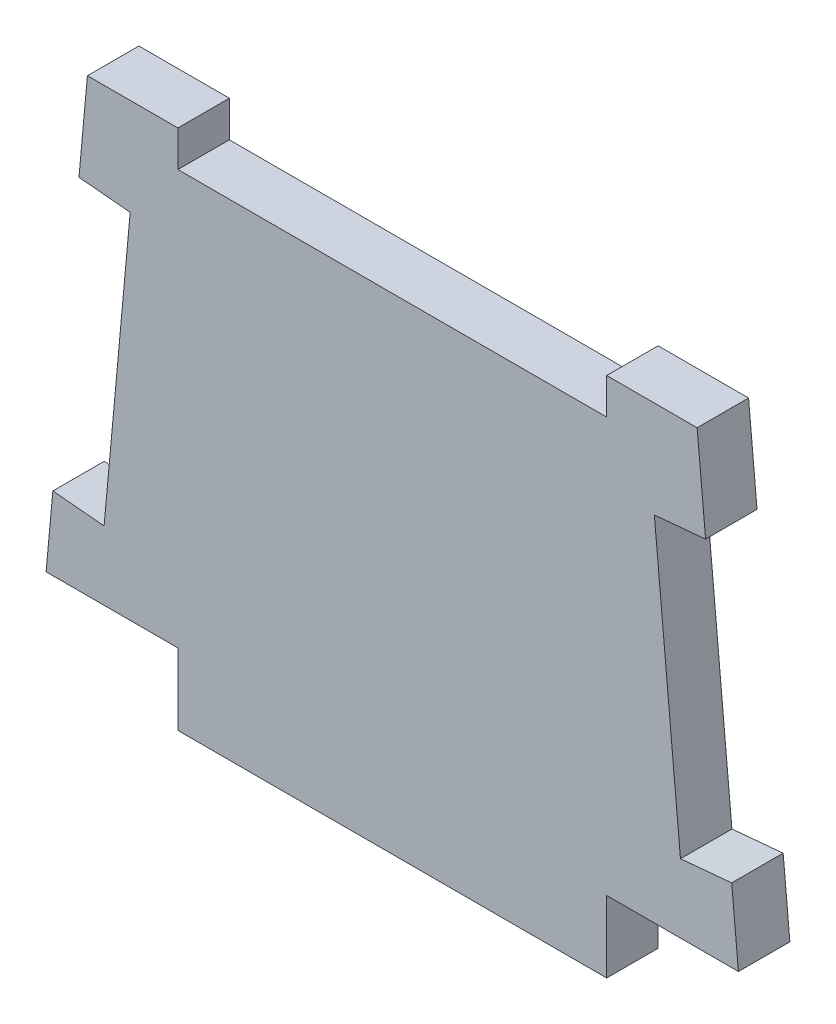
ISO-10303-21;
HEADER;
FILE_DESCRIPTION(('STEP AP214'),'2;1');
FILE_NAME('part.step','',(''),(''),'','','');
FILE_SCHEMA(('AUTOMOTIVE_DESIGN { 1 0 10303 214 1 1 1 1 }'));
ENDSEC;
DATA;
#1=APPLICATION_CONTEXT('core data for automotive mechanical design processes');
#2=APPLICATION_PROTOCOL_DEFINITION('international standard','automotive_design',2000,#1);
#3=PRODUCT_CONTEXT('',#1,'mechanical');
#4=PRODUCT('Part','Part','',(#3));
#5=PRODUCT_RELATED_PRODUCT_CATEGORY('part','',(#4));
#6=PRODUCT_DEFINITION_FORMATION('','',#4);
#7=PRODUCT_DEFINITION_CONTEXT('part definition',#1,'design');
#8=PRODUCT_DEFINITION('design','',#6,#7);
#9=PRODUCT_DEFINITION_SHAPE('','',#8);
#10=(LENGTH_UNIT() NAMED_UNIT(*) SI_UNIT(.MILLI.,.METRE.));
#11=(NAMED_UNIT(*) PLANE_ANGLE_UNIT() SI_UNIT($,.RADIAN.));
#12=(NAMED_UNIT(*) SI_UNIT($,.STERADIAN.) SOLID_ANGLE_UNIT());
#13=UNCERTAINTY_MEASURE_WITH_UNIT(LENGTH_MEASURE(1.E-05),#10,'distance_accuracy_value','');
#14=(GEOMETRIC_REPRESENTATION_CONTEXT(3) GLOBAL_UNCERTAINTY_ASSIGNED_CONTEXT((#13)) GLOBAL_UNIT_ASSIGNED_CONTEXT((#10,
#11,#12)) REPRESENTATION_CONTEXT('',''));
#15=CARTESIAN_POINT('',(0.,0.,0.));
#16=DIRECTION('',(0.,0.,1.));
#17=DIRECTION('',(1.,0.,0.));
#18=AXIS2_PLACEMENT_3D('',#15,#16,#17);
#19=CARTESIAN_POINT('',(-30.7594,-21.2768186594663,4.572));
#20=DIRECTION('',(0.,1.,0.));
#21=DIRECTION('',(0.,0.,1.));
#22=AXIS2_PLACEMENT_3D('',#19,#20,#21);
#23=PLANE('',#22);
#24=DIRECTION('',(0.,0.,1.));
#25=VECTOR('',#24,1.);
#26=CARTESIAN_POINT('',(19.05,-21.2768186594663,-38.6255420673937));
#27=LINE('',#26,#25);
#28=CARTESIAN_POINT('',(19.05,-21.2768186594663,0.));
#29=VERTEX_POINT('',#28);
#30=CARTESIAN_POINT('',(19.05,-21.2768186594663,4.572));
#31=VERTEX_POINT('',#30);
#32=EDGE_CURVE('E56',#29,#31,#27,.T.);
#33=ORIENTED_EDGE('',*,*,#32,.F.);
#34=DIRECTION('',(1.,0.,0.));
#35=VECTOR('',#34,1.);
#36=CARTESIAN_POINT('',(-30.7594,-21.2768186594663,0.));
#37=LINE('',#36,#35);
#38=CARTESIAN_POINT('',(30.7594,-21.2768186594663,0.));
#39=VERTEX_POINT('',#38);
#40=EDGE_CURVE('E311',#29,#39,#37,.T.);
#41=ORIENTED_EDGE('',*,*,#40,.T.);
#42=DIRECTION('',(0.,0.,-1.));
#43=VECTOR('',#42,1.);
#44=CARTESIAN_POINT('',(30.7594,-21.2768186594663,4.572));
#45=LINE('',#44,#43);
#46=CARTESIAN_POINT('',(30.7594,-21.2768186594663,4.572));
#47=VERTEX_POINT('',#46);
#48=EDGE_CURVE('E299',#47,#39,#45,.T.);
#49=ORIENTED_EDGE('',*,*,#48,.F.);
#50=DIRECTION('',(1.,0.,0.));
#51=VECTOR('',#50,1.);
#52=CARTESIAN_POINT('',(-30.7594,-21.2768186594663,4.572));
#53=LINE('',#52,#51);
#54=EDGE_CURVE('E297',#31,#47,#53,.T.);
#55=ORIENTED_EDGE('',*,*,#54,.F.);
#56=EDGE_LOOP('',(#33,#41,#49,#55));
#57=FACE_BOUND('',#56,.T.);
#58=ADVANCED_FACE('F33',(#57),#23,.F.);
#59=CARTESIAN_POINT('',(27.0891,18.7380075147157,4.572));
#60=DIRECTION('',(-0.995819758060214,-0.0913400758533503,0.));
#61=DIRECTION('',(0.0913400758533503,-0.995819758060214,0.));
#62=AXIS2_PLACEMENT_3D('',#59,#60,#61);
#63=PLANE('',#62);
#64=DIRECTION('',(-0.0913400758533503,0.995819758060214,0.));
#65=VECTOR('',#64,1.);
#66=CARTESIAN_POINT('',(27.0891,18.7380075147157,4.572));
#67=LINE('',#66,#65);
#68=CARTESIAN_POINT('',(27.8407922882427,10.5428092337834,4.572));
#69=VERTEX_POINT('',#68);
#70=CARTESIAN_POINT('',(27.0891,18.7380075147157,4.572));
#71=VERTEX_POINT('',#70);
#72=EDGE_CURVE('E289',#69,#71,#67,.T.);
#73=ORIENTED_EDGE('',*,*,#72,.F.);
#74=DIRECTION('',(0.,0.,1.));
#75=VECTOR('',#74,1.);
#76=CARTESIAN_POINT('',(27.8407922882427,10.5428092337834,0.));
#77=LINE('',#76,#75);
#78=CARTESIAN_POINT('',(27.8407922882427,10.5428092337834,0.));
#79=VERTEX_POINT('',#78);
#80=EDGE_CURVE('E250',#79,#69,#77,.T.);
#81=ORIENTED_EDGE('',*,*,#80,.F.);
#82=DIRECTION('',(-0.0913400758533503,0.995819758060214,0.));
#83=VECTOR('',#82,1.);
#84=CARTESIAN_POINT('',(27.0891,18.7380075147157,0.));
#85=LINE('',#84,#83);
#86=CARTESIAN_POINT('',(27.0891,18.7380075147157,0.));
#87=VERTEX_POINT('',#86);
#88=EDGE_CURVE('E228',#79,#87,#85,.T.);
#89=ORIENTED_EDGE('',*,*,#88,.T.);
#90=DIRECTION('',(0.,0.,-1.));
#91=VECTOR('',#90,1.);
#92=CARTESIAN_POINT('',(27.0891,18.7380075147157,4.572));
#93=LINE('',#92,#91);
#94=EDGE_CURVE('E11',#71,#87,#93,.T.);
#95=ORIENTED_EDGE('',*,*,#94,.F.);
#96=EDGE_LOOP('',(#73,#81,#89,#95));
#97=FACE_BOUND('',#96,.T.);
#98=ADVANCED_FACE('F360',(#97),#63,.F.);
#99=CARTESIAN_POINT('',(-27.0891,18.7380075147157,4.572));
#100=DIRECTION('',(0.,-1.,0.));
#101=DIRECTION('',(0.,0.,-1.));
#102=AXIS2_PLACEMENT_3D('',#99,#100,#101);
#103=PLANE('',#102);
#104=DIRECTION('',(-1.,0.,0.));
#105=VECTOR('',#104,1.);
#106=CARTESIAN_POINT('',(-27.0891,18.7380075147157,0.));
#107=LINE('',#106,#105);
#108=CARTESIAN_POINT('',(19.05,18.7380075147158,0.));
#109=VERTEX_POINT('',#108);
#110=EDGE_CURVE('E304',#87,#109,#107,.T.);
#111=ORIENTED_EDGE('',*,*,#110,.T.);
#112=DIRECTION('',(0.,0.,1.));
#113=VECTOR('',#112,1.);
#114=CARTESIAN_POINT('',(19.05,18.7380075147158,0.));
#115=LINE('',#114,#113);
#116=CARTESIAN_POINT('',(19.05,18.7380075147158,4.572));
#117=VERTEX_POINT('',#116);
#118=EDGE_CURVE('E217',#109,#117,#115,.T.);
#119=ORIENTED_EDGE('',*,*,#118,.T.);
#120=DIRECTION('',(-1.,0.,0.));
#121=VECTOR('',#120,1.);
#122=CARTESIAN_POINT('',(-27.0891,18.7380075147157,4.572));
#123=LINE('',#122,#121);
#124=EDGE_CURVE('E290',#71,#117,#123,.T.);
#125=ORIENTED_EDGE('',*,*,#124,.F.);
#126=ORIENTED_EDGE('',*,*,#94,.T.);
#127=EDGE_LOOP('',(#111,#119,#125,#126));
#128=FACE_BOUND('',#127,.T.);
#129=ADVANCED_FACE('F353',(#128),#103,.F.);
#130=CARTESIAN_POINT('',(-27.0891,18.7380075147157,4.572));
#131=DIRECTION('',(0.995819758060214,-0.0913400758533503,0.));
#132=DIRECTION('',(0.0913400758533503,0.995819758060214,0.));
#133=AXIS2_PLACEMENT_3D('',#130,#131,#132);
#134=PLANE('',#133);
#135=DIRECTION('',(-0.0913400758533503,-0.995819758060214,0.));
#136=VECTOR('',#135,1.);
#137=CARTESIAN_POINT('',(-27.0891,18.7380075147157,4.572));
#138=LINE('',#137,#136);
#139=CARTESIAN_POINT('',(-30.1608302149178,-14.7510126209461,4.572));
#140=VERTEX_POINT('',#139);
#141=CARTESIAN_POINT('',(-30.7594,-21.2768186594663,4.572));
#142=VERTEX_POINT('',#141);
#143=EDGE_CURVE('E293',#140,#142,#138,.T.);
#144=ORIENTED_EDGE('',*,*,#143,.F.);
#145=DIRECTION('',(0.,0.,1.));
#146=VECTOR('',#145,1.);
#147=CARTESIAN_POINT('',(-30.1608302149178,-14.7510126209461,0.));
#148=LINE('',#147,#146);
#149=CARTESIAN_POINT('',(-30.1608302149178,-14.7510126209461,0.));
#150=VERTEX_POINT('',#149);
#151=EDGE_CURVE('E221',#150,#140,#148,.T.);
#152=ORIENTED_EDGE('',*,*,#151,.F.);
#153=DIRECTION('',(-0.0913400758533503,-0.995819758060214,0.));
#154=VECTOR('',#153,1.);
#155=CARTESIAN_POINT('',(-27.0891,18.7380075147157,0.));
#156=LINE('',#155,#154);
#157=CARTESIAN_POINT('',(-30.7594,-21.2768186594663,0.));
#158=VERTEX_POINT('',#157);
#159=EDGE_CURVE('E307',#150,#158,#156,.T.);
#160=ORIENTED_EDGE('',*,*,#159,.T.);
#161=DIRECTION('',(0.,0.,-1.));
#162=VECTOR('',#161,1.);
#163=CARTESIAN_POINT('',(-30.7594,-21.2768186594663,4.572));
#164=LINE('',#163,#162);
#165=EDGE_CURVE('E316',#142,#158,#164,.T.);
#166=ORIENTED_EDGE('',*,*,#165,.F.);
#167=EDGE_LOOP('',(#144,#152,#160,#166));
#168=FACE_BOUND('',#167,.T.);
#169=ADVANCED_FACE('F384',(#168),#134,.F.);
#170=CARTESIAN_POINT('',(30.1608302149178,-14.7510126209461,0.));
#171=VERTEX_POINT('',#170);
#172=EDGE_CURVE('E300',#39,#171,#85,.T.);
#173=ORIENTED_EDGE('',*,*,#172,.T.);
#174=DIRECTION('',(0.,0.,1.));
#175=VECTOR('',#174,1.);
#176=CARTESIAN_POINT('',(30.1608302149178,-14.7510126209461,0.));
#177=LINE('',#176,#175);
#178=CARTESIAN_POINT('',(30.1608302149178,-14.7510126209461,4.572));
#179=VERTEX_POINT('',#178);
#180=EDGE_CURVE('E279',#171,#179,#177,.T.);
#181=ORIENTED_EDGE('',*,*,#180,.T.);
#182=EDGE_CURVE('E285',#47,#179,#67,.T.);
#183=ORIENTED_EDGE('',*,*,#182,.F.);
#184=ORIENTED_EDGE('',*,*,#48,.T.);
#185=EDGE_LOOP('',(#173,#181,#183,#184));
#186=FACE_BOUND('',#185,.T.);
#187=ADVANCED_FACE('F35',(#186),#63,.F.);
#188=CARTESIAN_POINT('',(-19.05,18.7380075147158,4.572));
#189=VERTEX_POINT('',#188);
#190=CARTESIAN_POINT('',(-27.0891,18.7380075147157,4.572));
#191=VERTEX_POINT('',#190);
#192=EDGE_CURVE('E288',#189,#191,#123,.T.);
#193=ORIENTED_EDGE('',*,*,#192,.F.);
#194=DIRECTION('',(0.,0.,1.));
#195=VECTOR('',#194,1.);
#196=CARTESIAN_POINT('',(-19.05,18.7380075147158,0.));
#197=LINE('',#196,#195);
#198=CARTESIAN_POINT('',(-19.05,18.7380075147158,0.));
#199=VERTEX_POINT('',#198);
#200=EDGE_CURVE('E231',#199,#189,#197,.T.);
#201=ORIENTED_EDGE('',*,*,#200,.F.);
#202=CARTESIAN_POINT('',(-27.0891,18.7380075147157,0.));
#203=VERTEX_POINT('',#202);
#204=EDGE_CURVE('E303',#199,#203,#107,.T.);
#205=ORIENTED_EDGE('',*,*,#204,.T.);
#206=DIRECTION('',(0.,0.,-1.));
#207=VECTOR('',#206,1.);
#208=CARTESIAN_POINT('',(-27.0891,18.7380075147157,4.572));
#209=LINE('',#208,#207);
#210=EDGE_CURVE('E41',#191,#203,#209,.T.);
#211=ORIENTED_EDGE('',*,*,#210,.F.);
#212=EDGE_LOOP('',(#193,#201,#205,#211));
#213=FACE_BOUND('',#212,.T.);
#214=ADVANCED_FACE('F341',(#213),#103,.F.);
#215=CARTESIAN_POINT('',(-27.8407922882427,10.5428092337834,0.));
#216=VERTEX_POINT('',#215);
#217=EDGE_CURVE('E308',#203,#216,#156,.T.);
#218=ORIENTED_EDGE('',*,*,#217,.T.);
#219=DIRECTION('',(0.,0.,1.));
#220=VECTOR('',#219,1.);
#221=CARTESIAN_POINT('',(-27.8407922882427,10.5428092337834,0.));
#222=LINE('',#221,#220);
#223=CARTESIAN_POINT('',(-27.8407922882427,10.5428092337834,4.572));
#224=VERTEX_POINT('',#223);
#225=EDGE_CURVE('E255',#216,#224,#222,.T.);
#226=ORIENTED_EDGE('',*,*,#225,.T.);
#227=EDGE_CURVE('E294',#191,#224,#138,.T.);
#228=ORIENTED_EDGE('',*,*,#227,.F.);
#229=ORIENTED_EDGE('',*,*,#210,.T.);
#230=EDGE_LOOP('',(#218,#226,#228,#229));
#231=FACE_BOUND('',#230,.T.);
#232=ADVANCED_FACE('F323',(#231),#134,.F.);
#233=CARTESIAN_POINT('',(-19.05,-21.2768186594663,0.));
#234=VERTEX_POINT('',#233);
#235=EDGE_CURVE('E312',#158,#234,#37,.T.);
#236=ORIENTED_EDGE('',*,*,#235,.T.);
#237=DIRECTION('',(0.,0.,1.));
#238=VECTOR('',#237,1.);
#239=CARTESIAN_POINT('',(-19.05,-21.2768186594663,-38.6255420673937));
#240=LINE('',#239,#238);
#241=CARTESIAN_POINT('',(-19.05,-21.2768186594663,4.572));
#242=VERTEX_POINT('',#241);
#243=EDGE_CURVE('E48',#234,#242,#240,.T.);
#244=ORIENTED_EDGE('',*,*,#243,.T.);
#245=EDGE_CURVE('E194',#142,#242,#53,.T.);
#246=ORIENTED_EDGE('',*,*,#245,.F.);
#247=ORIENTED_EDGE('',*,*,#165,.T.);
#248=EDGE_LOOP('',(#236,#244,#246,#247));
#249=FACE_BOUND('',#248,.T.);
#250=ADVANCED_FACE('F380',(#249),#23,.F.);
#251=CARTESIAN_POINT('',(0.,0.,4.572));
#252=DIRECTION('',(0.,0.,1.));
#253=DIRECTION('',(1.,0.,0.));
#254=AXIS2_PLACEMENT_3D('',#251,#252,#253);
#255=PLANE('',#254);
#256=DIRECTION('',(0.,1.,0.));
#257=VECTOR('',#256,1.);
#258=CARTESIAN_POINT('',(19.05,18.7380075147158,4.572));
#259=LINE('',#258,#257);
#260=CARTESIAN_POINT('',(19.05,15.5376075147158,4.572));
#261=VERTEX_POINT('',#260);
#262=EDGE_CURVE('E218',#261,#117,#259,.T.);
#263=ORIENTED_EDGE('',*,*,#262,.F.);
#264=DIRECTION('',(1.,0.,0.));
#265=VECTOR('',#264,1.);
#266=CARTESIAN_POINT('',(19.05,15.5376075147158,4.572));
#267=LINE('',#266,#265);
#268=CARTESIAN_POINT('',(-19.05,15.5376075147158,4.572));
#269=VERTEX_POINT('',#268);
#270=EDGE_CURVE('E211',#269,#261,#267,.T.);
#271=ORIENTED_EDGE('',*,*,#270,.F.);
#272=DIRECTION('',(0.,-1.,0.));
#273=VECTOR('',#272,1.);
#274=CARTESIAN_POINT('',(-19.05,18.7380075147158,4.572));
#275=LINE('',#274,#273);
#276=EDGE_CURVE('E220',#189,#269,#275,.T.);
#277=ORIENTED_EDGE('',*,*,#276,.F.);
#278=ORIENTED_EDGE('',*,*,#192,.T.);
#279=ORIENTED_EDGE('',*,*,#227,.T.);
#280=DIRECTION('',(-0.995819758060214,0.0913400758533506,0.));
#281=VECTOR('',#280,1.);
#282=CARTESIAN_POINT('',(-27.8407922882427,10.5428092337834,4.572));
#283=LINE('',#282,#281);
#284=CARTESIAN_POINT('',(-23.2879043543914,10.1252024069819,4.572));
#285=VERTEX_POINT('',#284);
#286=EDGE_CURVE('E239',#285,#224,#283,.T.);
#287=ORIENTED_EDGE('',*,*,#286,.F.);
#288=DIRECTION('',(0.0913400758533499,0.995819758060214,0.));
#289=VECTOR('',#288,1.);
#290=CARTESIAN_POINT('',(-25.6079422810665,-15.1686194477476,4.572));
#291=LINE('',#290,#289);
#292=CARTESIAN_POINT('',(-25.6079422810665,-15.1686194477476,4.572));
#293=VERTEX_POINT('',#292);
#294=EDGE_CURVE('E249',#293,#285,#291,.T.);
#295=ORIENTED_EDGE('',*,*,#294,.F.);
#296=DIRECTION('',(0.995819758060214,-0.091340075853351,0.));
#297=VECTOR('',#296,1.);
#298=CARTESIAN_POINT('',(-30.1608302149178,-14.7510126209461,4.572));
#299=LINE('',#298,#297);
#300=EDGE_CURVE('E246',#140,#293,#299,.T.);
#301=ORIENTED_EDGE('',*,*,#300,.F.);
#302=ORIENTED_EDGE('',*,*,#143,.T.);
#303=ORIENTED_EDGE('',*,*,#245,.T.);
#304=DIRECTION('',(0.,-1.,0.));
#305=VECTOR('',#304,1.);
#306=CARTESIAN_POINT('',(-19.05,-21.2768186594663,4.572));
#307=LINE('',#306,#305);
#308=CARTESIAN_POINT('',(-19.05,-27.6268186594662,4.572));
#309=VERTEX_POINT('',#308);
#310=EDGE_CURVE('E176',#242,#309,#307,.T.);
#311=ORIENTED_EDGE('',*,*,#310,.T.);
#312=DIRECTION('',(1.,0.,0.));
#313=VECTOR('',#312,1.);
#314=CARTESIAN_POINT('',(-19.05,-27.6268186594662,4.572));
#315=LINE('',#314,#313);
#316=CARTESIAN_POINT('',(19.05,-27.6268186594663,4.572));
#317=VERTEX_POINT('',#316);
#318=EDGE_CURVE('E185',#309,#317,#315,.T.);
#319=ORIENTED_EDGE('',*,*,#318,.T.);
#320=DIRECTION('',(0.,1.,0.));
#321=VECTOR('',#320,1.);
#322=CARTESIAN_POINT('',(19.05,-21.2768186594663,4.572));
#323=LINE('',#322,#321);
#324=EDGE_CURVE('E182',#317,#31,#323,.T.);
#325=ORIENTED_EDGE('',*,*,#324,.T.);
#326=ORIENTED_EDGE('',*,*,#54,.T.);
#327=ORIENTED_EDGE('',*,*,#182,.T.);
#328=DIRECTION('',(0.995819758060214,0.0913400758533502,0.));
#329=VECTOR('',#328,1.);
#330=CARTESIAN_POINT('',(30.1608302149178,-14.7510126209461,4.572));
#331=LINE('',#330,#329);
#332=CARTESIAN_POINT('',(25.6079422810665,-15.1686194477476,4.572));
#333=VERTEX_POINT('',#332);
#334=EDGE_CURVE('E265',#333,#179,#331,.T.);
#335=ORIENTED_EDGE('',*,*,#334,.F.);
#336=DIRECTION('',(0.0913400758533501,-0.995819758060214,0.));
#337=VECTOR('',#336,1.);
#338=CARTESIAN_POINT('',(23.2879043543914,10.1252024069819,4.572));
#339=LINE('',#338,#337);
#340=CARTESIAN_POINT('',(23.2879043543914,10.1252024069819,4.572));
#341=VERTEX_POINT('',#340);
#342=EDGE_CURVE('E274',#341,#333,#339,.T.);
#343=ORIENTED_EDGE('',*,*,#342,.F.);
#344=DIRECTION('',(-0.995819758060214,-0.0913400758533502,0.));
#345=VECTOR('',#344,1.);
#346=CARTESIAN_POINT('',(27.8407922882427,10.5428092337834,4.572));
#347=LINE('',#346,#345);
#348=EDGE_CURVE('E206',#69,#341,#347,.T.);
#349=ORIENTED_EDGE('',*,*,#348,.F.);
#350=ORIENTED_EDGE('',*,*,#72,.T.);
#351=ORIENTED_EDGE('',*,*,#124,.T.);
#352=EDGE_LOOP('',(#263,#271,#277,#278,#279,#287,#295,#301,#302,#303,#311,#319,#325,#326,#327,
#335,#343,#349,#350,#351));
#353=FACE_BOUND('',#352,.T.);
#354=ADVANCED_FACE('F193',(#353),#255,.T.);
#355=CARTESIAN_POINT('',(0.,0.,0.));
#356=DIRECTION('',(0.,0.,1.));
#357=DIRECTION('',(1.,0.,0.));
#358=AXIS2_PLACEMENT_3D('',#355,#356,#357);
#359=PLANE('',#358);
#360=DIRECTION('',(1.,0.,0.));
#361=VECTOR('',#360,1.);
#362=CARTESIAN_POINT('',(19.05,15.5376075147158,0.));
#363=LINE('',#362,#361);
#364=CARTESIAN_POINT('',(-19.05,15.5376075147158,0.));
#365=VERTEX_POINT('',#364);
#366=CARTESIAN_POINT('',(19.05,15.5376075147158,0.));
#367=VERTEX_POINT('',#366);
#368=EDGE_CURVE('E214',#365,#367,#363,.T.);
#369=ORIENTED_EDGE('',*,*,#368,.T.);
#370=DIRECTION('',(0.,1.,0.));
#371=VECTOR('',#370,1.);
#372=CARTESIAN_POINT('',(19.05,18.7380075147158,0.));
#373=LINE('',#372,#371);
#374=EDGE_CURVE('E207',#367,#109,#373,.T.);
#375=ORIENTED_EDGE('',*,*,#374,.T.);
#376=ORIENTED_EDGE('',*,*,#110,.F.);
#377=ORIENTED_EDGE('',*,*,#88,.F.);
#378=DIRECTION('',(-0.995819758060214,-0.0913400758533502,0.));
#379=VECTOR('',#378,1.);
#380=CARTESIAN_POINT('',(27.8407922882427,10.5428092337834,0.));
#381=LINE('',#380,#379);
#382=CARTESIAN_POINT('',(23.2879043543914,10.1252024069819,0.));
#383=VERTEX_POINT('',#382);
#384=EDGE_CURVE('E261',#79,#383,#381,.T.);
#385=ORIENTED_EDGE('',*,*,#384,.T.);
#386=DIRECTION('',(0.0913400758533501,-0.995819758060214,0.));
#387=VECTOR('',#386,1.);
#388=CARTESIAN_POINT('',(23.2879043543914,10.1252024069819,0.));
#389=LINE('',#388,#387);
#390=CARTESIAN_POINT('',(25.6079422810665,-15.1686194477476,0.));
#391=VERTEX_POINT('',#390);
#392=EDGE_CURVE('E264',#383,#391,#389,.T.);
#393=ORIENTED_EDGE('',*,*,#392,.T.);
#394=DIRECTION('',(0.995819758060214,0.0913400758533502,0.));
#395=VECTOR('',#394,1.);
#396=CARTESIAN_POINT('',(30.1608302149178,-14.7510126209461,0.));
#397=LINE('',#396,#395);
#398=EDGE_CURVE('E268',#391,#171,#397,.T.);
#399=ORIENTED_EDGE('',*,*,#398,.T.);
#400=ORIENTED_EDGE('',*,*,#172,.F.);
#401=ORIENTED_EDGE('',*,*,#40,.F.);
#402=DIRECTION('',(0.,-1.,0.));
#403=VECTOR('',#402,1.);
#404=CARTESIAN_POINT('',(19.05,-21.2768186594663,0.));
#405=LINE('',#404,#403);
#406=CARTESIAN_POINT('',(19.05,-27.6268186594663,0.));
#407=VERTEX_POINT('',#406);
#408=EDGE_CURVE('E201',#29,#407,#405,.T.);
#409=ORIENTED_EDGE('',*,*,#408,.T.);
#410=DIRECTION('',(-1.,0.,0.));
#411=VECTOR('',#410,1.);
#412=CARTESIAN_POINT('',(-19.05,-27.6268186594662,0.));
#413=LINE('',#412,#411);
#414=CARTESIAN_POINT('',(-19.05,-27.6268186594662,0.));
#415=VERTEX_POINT('',#414);
#416=EDGE_CURVE('E204',#407,#415,#413,.T.);
#417=ORIENTED_EDGE('',*,*,#416,.T.);
#418=DIRECTION('',(0.,1.,0.));
#419=VECTOR('',#418,1.);
#420=CARTESIAN_POINT('',(-19.05,-21.2768186594663,0.));
#421=LINE('',#420,#419);
#422=EDGE_CURVE('E178',#415,#234,#421,.T.);
#423=ORIENTED_EDGE('',*,*,#422,.T.);
#424=ORIENTED_EDGE('',*,*,#235,.F.);
#425=ORIENTED_EDGE('',*,*,#159,.F.);
#426=DIRECTION('',(0.995819758060214,-0.091340075853351,0.));
#427=VECTOR('',#426,1.);
#428=CARTESIAN_POINT('',(-30.1608302149178,-14.7510126209461,0.));
#429=LINE('',#428,#427);
#430=CARTESIAN_POINT('',(-25.6079422810665,-15.1686194477476,0.));
#431=VERTEX_POINT('',#430);
#432=EDGE_CURVE('E235',#150,#431,#429,.T.);
#433=ORIENTED_EDGE('',*,*,#432,.T.);
#434=DIRECTION('',(0.0913400758533499,0.995819758060214,0.));
#435=VECTOR('',#434,1.);
#436=CARTESIAN_POINT('',(-25.6079422810665,-15.1686194477476,0.));
#437=LINE('',#436,#435);
#438=CARTESIAN_POINT('',(-23.2879043543914,10.1252024069819,0.));
#439=VERTEX_POINT('',#438);
#440=EDGE_CURVE('E238',#431,#439,#437,.T.);
#441=ORIENTED_EDGE('',*,*,#440,.T.);
#442=DIRECTION('',(-0.995819758060214,0.0913400758533506,0.));
#443=VECTOR('',#442,1.);
#444=CARTESIAN_POINT('',(-27.8407922882427,10.5428092337834,0.));
#445=LINE('',#444,#443);
#446=EDGE_CURVE('E242',#439,#216,#445,.T.);
#447=ORIENTED_EDGE('',*,*,#446,.T.);
#448=ORIENTED_EDGE('',*,*,#217,.F.);
#449=ORIENTED_EDGE('',*,*,#204,.F.);
#450=DIRECTION('',(0.,-1.,0.));
#451=VECTOR('',#450,1.);
#452=CARTESIAN_POINT('',(-19.05,18.7380075147158,0.));
#453=LINE('',#452,#451);
#454=EDGE_CURVE('E210',#199,#365,#453,.T.);
#455=ORIENTED_EDGE('',*,*,#454,.T.);
#456=EDGE_LOOP('',(#369,#375,#376,#377,#385,#393,#399,#400,#401,#409,#417,#423,#424,#425,#433,
#441,#447,#448,#449,#455));
#457=FACE_BOUND('',#456,.T.);
#458=ADVANCED_FACE('F328',(#457),#359,.F.);
#459=CARTESIAN_POINT('',(27.8407922882427,10.5428092337834,0.));
#460=DIRECTION('',(-0.0913400758533502,0.995819758060214,0.));
#461=DIRECTION('',(-0.995819758060214,-0.0913400758533502,0.));
#462=AXIS2_PLACEMENT_3D('',#459,#460,#461);
#463=PLANE('',#462);
#464=ORIENTED_EDGE('',*,*,#348,.T.);
#465=DIRECTION('',(0.,0.,1.));
#466=VECTOR('',#465,1.);
#467=CARTESIAN_POINT('',(23.2879043543914,10.1252024069819,0.));
#468=LINE('',#467,#466);
#469=EDGE_CURVE('E271',#383,#341,#468,.T.);
#470=ORIENTED_EDGE('',*,*,#469,.F.);
#471=ORIENTED_EDGE('',*,*,#384,.F.);
#472=ORIENTED_EDGE('',*,*,#80,.T.);
#473=EDGE_LOOP('',(#464,#470,#471,#472));
#474=FACE_BOUND('',#473,.T.);
#475=ADVANCED_FACE('F364',(#474),#463,.F.);
#476=CARTESIAN_POINT('',(30.1608302149178,-14.7510126209461,0.));
#477=DIRECTION('',(0.0913400758533502,-0.995819758060214,0.));
#478=DIRECTION('',(0.995819758060214,0.0913400758533502,0.));
#479=AXIS2_PLACEMENT_3D('',#476,#477,#478);
#480=PLANE('',#479);
#481=ORIENTED_EDGE('',*,*,#334,.T.);
#482=ORIENTED_EDGE('',*,*,#180,.F.);
#483=ORIENTED_EDGE('',*,*,#398,.F.);
#484=DIRECTION('',(0.,0.,1.));
#485=VECTOR('',#484,1.);
#486=CARTESIAN_POINT('',(25.6079422810665,-15.1686194477476,0.));
#487=LINE('',#486,#485);
#488=EDGE_CURVE('E282',#391,#333,#487,.T.);
#489=ORIENTED_EDGE('',*,*,#488,.T.);
#490=EDGE_LOOP('',(#481,#482,#483,#489));
#491=FACE_BOUND('',#490,.T.);
#492=ADVANCED_FACE('F370',(#491),#480,.F.);
#493=CARTESIAN_POINT('',(23.2879043543914,10.1252024069819,0.));
#494=DIRECTION('',(-0.995819758060214,-0.0913400758533501,0.));
#495=DIRECTION('',(0.0913400758533501,-0.995819758060215,0.));
#496=AXIS2_PLACEMENT_3D('',#493,#494,#495);
#497=PLANE('',#496);
#498=ORIENTED_EDGE('',*,*,#342,.T.);
#499=ORIENTED_EDGE('',*,*,#488,.F.);
#500=ORIENTED_EDGE('',*,*,#392,.F.);
#501=ORIENTED_EDGE('',*,*,#469,.T.);
#502=EDGE_LOOP('',(#498,#499,#500,#501));
#503=FACE_BOUND('',#502,.T.);
#504=ADVANCED_FACE('F367',(#503),#497,.F.);
#505=CARTESIAN_POINT('',(-30.1608302149178,-14.7510126209461,0.));
#506=DIRECTION('',(-0.091340075853351,-0.995819758060214,0.));
#507=DIRECTION('',(0.995819758060214,-0.091340075853351,0.));
#508=AXIS2_PLACEMENT_3D('',#505,#506,#507);
#509=PLANE('',#508);
#510=ORIENTED_EDGE('',*,*,#300,.T.);
#511=DIRECTION('',(0.,0.,1.));
#512=VECTOR('',#511,1.);
#513=CARTESIAN_POINT('',(-25.6079422810665,-15.1686194477476,0.));
#514=LINE('',#513,#512);
#515=EDGE_CURVE('E245',#431,#293,#514,.T.);
#516=ORIENTED_EDGE('',*,*,#515,.F.);
#517=ORIENTED_EDGE('',*,*,#432,.F.);
#518=ORIENTED_EDGE('',*,*,#151,.T.);
#519=EDGE_LOOP('',(#510,#516,#517,#518));
#520=FACE_BOUND('',#519,.T.);
#521=ADVANCED_FACE('F387',(#520),#509,.F.);
#522=CARTESIAN_POINT('',(-27.8407922882427,10.5428092337834,0.));
#523=DIRECTION('',(0.0913400758533506,0.995819758060214,0.));
#524=DIRECTION('',(-0.995819758060214,0.0913400758533506,0.));
#525=AXIS2_PLACEMENT_3D('',#522,#523,#524);
#526=PLANE('',#525);
#527=ORIENTED_EDGE('',*,*,#286,.T.);
#528=ORIENTED_EDGE('',*,*,#225,.F.);
#529=ORIENTED_EDGE('',*,*,#446,.F.);
#530=DIRECTION('',(0.,0.,1.));
#531=VECTOR('',#530,1.);
#532=CARTESIAN_POINT('',(-23.2879043543914,10.1252024069819,0.));
#533=LINE('',#532,#531);
#534=EDGE_CURVE('E258',#439,#285,#533,.T.);
#535=ORIENTED_EDGE('',*,*,#534,.T.);
#536=EDGE_LOOP('',(#527,#528,#529,#535));
#537=FACE_BOUND('',#536,.T.);
#538=ADVANCED_FACE('F332',(#537),#526,.F.);
#539=CARTESIAN_POINT('',(-25.6079422810665,-15.1686194477476,0.));
#540=DIRECTION('',(0.995819758060214,-0.0913400758533499,0.));
#541=DIRECTION('',(0.0913400758533499,0.995819758060215,0.));
#542=AXIS2_PLACEMENT_3D('',#539,#540,#541);
#543=PLANE('',#542);
#544=ORIENTED_EDGE('',*,*,#294,.T.);
#545=ORIENTED_EDGE('',*,*,#534,.F.);
#546=ORIENTED_EDGE('',*,*,#440,.F.);
#547=ORIENTED_EDGE('',*,*,#515,.T.);
#548=EDGE_LOOP('',(#544,#545,#546,#547));
#549=FACE_BOUND('',#548,.T.);
#550=ADVANCED_FACE('F334',(#549),#543,.F.);
#551=CARTESIAN_POINT('',(19.05,18.7380075147158,0.));
#552=DIRECTION('',(1.,0.,0.));
#553=DIRECTION('',(0.,0.,-1.));
#554=AXIS2_PLACEMENT_3D('',#551,#552,#553);
#555=PLANE('',#554);
#556=ORIENTED_EDGE('',*,*,#262,.T.);
#557=ORIENTED_EDGE('',*,*,#118,.F.);
#558=ORIENTED_EDGE('',*,*,#374,.F.);
#559=DIRECTION('',(0.,0.,1.));
#560=VECTOR('',#559,1.);
#561=CARTESIAN_POINT('',(19.05,15.5376075147158,0.));
#562=LINE('',#561,#560);
#563=EDGE_CURVE('E226',#367,#261,#562,.T.);
#564=ORIENTED_EDGE('',*,*,#563,.T.);
#565=EDGE_LOOP('',(#556,#557,#558,#564));
#566=FACE_BOUND('',#565,.T.);
#567=ADVANCED_FACE('F350',(#566),#555,.F.);
#568=CARTESIAN_POINT('',(19.05,15.5376075147158,0.));
#569=DIRECTION('',(0.,-1.,0.));
#570=DIRECTION('',(1.,0.,0.));
#571=AXIS2_PLACEMENT_3D('',#568,#569,#570);
#572=PLANE('',#571);
#573=ORIENTED_EDGE('',*,*,#270,.T.);
#574=ORIENTED_EDGE('',*,*,#563,.F.);
#575=ORIENTED_EDGE('',*,*,#368,.F.);
#576=DIRECTION('',(0.,0.,1.));
#577=VECTOR('',#576,1.);
#578=CARTESIAN_POINT('',(-19.05,15.5376075147158,0.));
#579=LINE('',#578,#577);
#580=EDGE_CURVE('E229',#365,#269,#579,.T.);
#581=ORIENTED_EDGE('',*,*,#580,.T.);
#582=EDGE_LOOP('',(#573,#574,#575,#581));
#583=FACE_BOUND('',#582,.T.);
#584=ADVANCED_FACE('F348',(#583),#572,.F.);
#585=CARTESIAN_POINT('',(-19.05,18.7380075147158,0.));
#586=DIRECTION('',(-1.,0.,0.));
#587=DIRECTION('',(0.,0.,1.));
#588=AXIS2_PLACEMENT_3D('',#585,#586,#587);
#589=PLANE('',#588);
#590=ORIENTED_EDGE('',*,*,#276,.T.);
#591=ORIENTED_EDGE('',*,*,#580,.F.);
#592=ORIENTED_EDGE('',*,*,#454,.F.);
#593=ORIENTED_EDGE('',*,*,#200,.T.);
#594=EDGE_LOOP('',(#590,#591,#592,#593));
#595=FACE_BOUND('',#594,.T.);
#596=ADVANCED_FACE('F343',(#595),#589,.F.);
#597=CARTESIAN_POINT('',(-19.05,-21.2768186594663,-38.6255420673937));
#598=DIRECTION('',(-1.,0.,0.));
#599=DIRECTION('',(0.,0.,1.));
#600=AXIS2_PLACEMENT_3D('',#597,#598,#599);
#601=PLANE('',#600);
#602=ORIENTED_EDGE('',*,*,#422,.F.);
#603=DIRECTION('',(0.,0.,1.));
#604=VECTOR('',#603,1.);
#605=CARTESIAN_POINT('',(-19.05,-27.6268186594662,-38.6255420673937));
#606=LINE('',#605,#604);
#607=EDGE_CURVE('E172',#415,#309,#606,.T.);
#608=ORIENTED_EDGE('',*,*,#607,.T.);
#609=ORIENTED_EDGE('',*,*,#310,.F.);
#610=ORIENTED_EDGE('',*,*,#243,.F.);
#611=EDGE_LOOP('',(#602,#608,#609,#610));
#612=FACE_BOUND('',#611,.T.);
#613=ADVANCED_FACE('F174',(#612),#601,.T.);
#614=CARTESIAN_POINT('',(19.05,-21.2768186594663,-38.6255420673937));
#615=DIRECTION('',(1.,0.,0.));
#616=DIRECTION('',(0.,0.,-1.));
#617=AXIS2_PLACEMENT_3D('',#614,#615,#616);
#618=PLANE('',#617);
#619=ORIENTED_EDGE('',*,*,#408,.F.);
#620=ORIENTED_EDGE('',*,*,#32,.T.);
#621=ORIENTED_EDGE('',*,*,#324,.F.);
#622=DIRECTION('',(0.,0.,1.));
#623=VECTOR('',#622,1.);
#624=CARTESIAN_POINT('',(19.05,-27.6268186594663,-38.6255420673937));
#625=LINE('',#624,#623);
#626=EDGE_CURVE('E181',#407,#317,#625,.T.);
#627=ORIENTED_EDGE('',*,*,#626,.F.);
#628=EDGE_LOOP('',(#619,#620,#621,#627));
#629=FACE_BOUND('',#628,.T.);
#630=ADVANCED_FACE('F377',(#629),#618,.T.);
#631=CARTESIAN_POINT('',(-19.05,-27.6268186594662,-38.6255420673937));
#632=DIRECTION('',(0.,-1.,0.));
#633=DIRECTION('',(1.,0.,0.));
#634=AXIS2_PLACEMENT_3D('',#631,#632,#633);
#635=PLANE('',#634);
#636=ORIENTED_EDGE('',*,*,#416,.F.);
#637=ORIENTED_EDGE('',*,*,#626,.T.);
#638=ORIENTED_EDGE('',*,*,#318,.F.);
#639=ORIENTED_EDGE('',*,*,#607,.F.);
#640=EDGE_LOOP('',(#636,#637,#638,#639));
#641=FACE_BOUND('',#640,.T.);
#642=ADVANCED_FACE('F186',(#641),#635,.T.);
#643=CLOSED_SHELL('',(#58,#98,#129,#169,#187,#214,#232,#250,#354,#458,#475,#492,#504,#521,#538,
#550,#567,#584,#596,#613,#630,#642));
#644=MANIFOLD_SOLID_BREP('B2',#643);
#645=ADVANCED_BREP_SHAPE_REPRESENTATION('',(#18,#644),#14);
#646=SHAPE_DEFINITION_REPRESENTATION(#9,#645);
ENDSEC;
END-ISO-10303-21;
